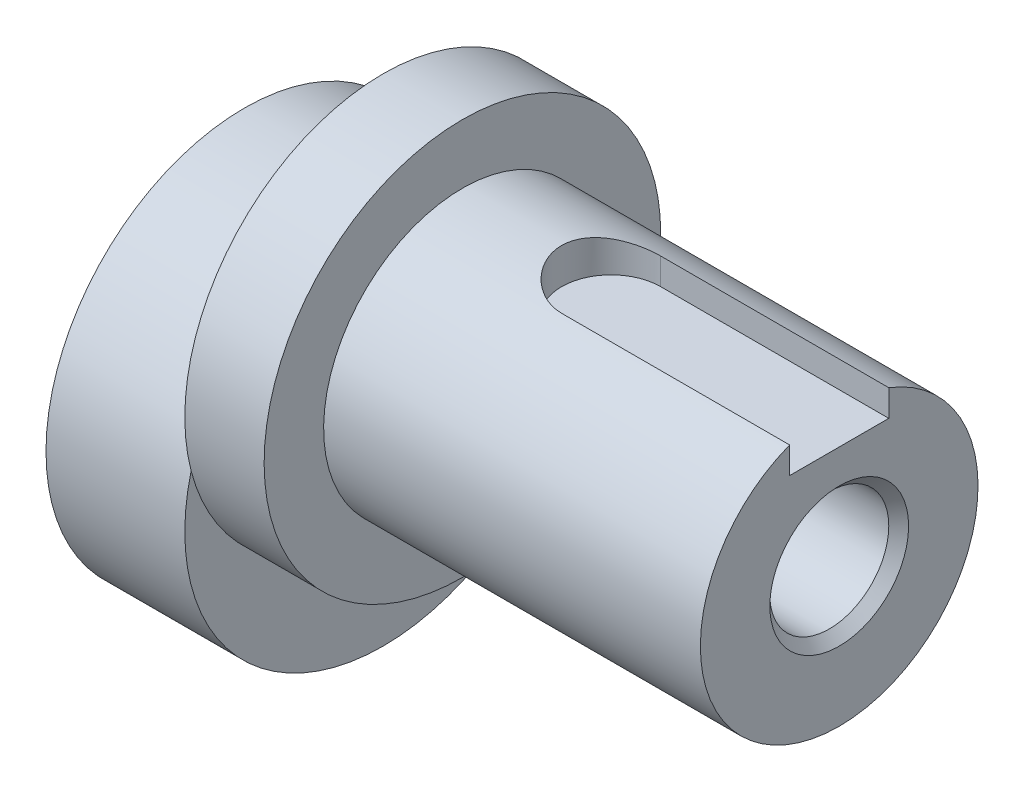
ISO-10303-21;
HEADER;
FILE_DESCRIPTION(('STEP AP214'),'2;1');
FILE_NAME('part.step','',(''),(''),'','','');
FILE_SCHEMA(('AUTOMOTIVE_DESIGN { 1 0 10303 214 1 1 1 1 }'));
ENDSEC;
DATA;
#1=APPLICATION_CONTEXT('core data for automotive mechanical design processes');
#2=APPLICATION_PROTOCOL_DEFINITION('international standard','automotive_design',2000,#1);
#3=PRODUCT_CONTEXT('',#1,'mechanical');
#4=PRODUCT('Part','Part','',(#3));
#5=PRODUCT_RELATED_PRODUCT_CATEGORY('part','',(#4));
#6=PRODUCT_DEFINITION_FORMATION('','',#4);
#7=PRODUCT_DEFINITION_CONTEXT('part definition',#1,'design');
#8=PRODUCT_DEFINITION('design','',#6,#7);
#9=PRODUCT_DEFINITION_SHAPE('','',#8);
#10=(LENGTH_UNIT() NAMED_UNIT(*) SI_UNIT(.MILLI.,.METRE.));
#11=(NAMED_UNIT(*) PLANE_ANGLE_UNIT() SI_UNIT($,.RADIAN.));
#12=(NAMED_UNIT(*) SI_UNIT($,.STERADIAN.) SOLID_ANGLE_UNIT());
#13=UNCERTAINTY_MEASURE_WITH_UNIT(LENGTH_MEASURE(1.E-05),#10,'distance_accuracy_value','');
#14=(GEOMETRIC_REPRESENTATION_CONTEXT(3) GLOBAL_UNCERTAINTY_ASSIGNED_CONTEXT((#13)) GLOBAL_UNIT_ASSIGNED_CONTEXT((#10,
#11,#12)) REPRESENTATION_CONTEXT('',''));
#15=CARTESIAN_POINT('',(0.,0.,0.));
#16=DIRECTION('',(0.,0.,1.));
#17=DIRECTION('',(1.,0.,0.));
#18=AXIS2_PLACEMENT_3D('',#15,#16,#17);
#19=CARTESIAN_POINT('',(30.,5.,0.));
#20=DIRECTION('',(-1.,0.,0.));
#21=DIRECTION('',(0.,0.,1.));
#22=AXIS2_PLACEMENT_3D('',#19,#20,#21);
#23=CYLINDRICAL_SURFACE('',#22,7.);
#24=CARTESIAN_POINT('',(11.,5.,0.));
#25=DIRECTION('',(1.,0.,0.));
#26=DIRECTION('',(0.,0.,-1.));
#27=AXIS2_PLACEMENT_3D('',#24,#25,#26);
#28=CIRCLE('',#27,7.);
#29=CARTESIAN_POINT('',(11.,5.,-7.));
#30=VERTEX_POINT('',#29);
#31=EDGE_CURVE('E123',#30,#30,#28,.T.);
#32=ORIENTED_EDGE('',*,*,#31,.T.);
#33=EDGE_LOOP('',(#32));
#34=FACE_BOUND('',#33,.T.);
#35=DIRECTION('',(-1.,0.,0.));
#36=VECTOR('',#35,1.);
#37=CARTESIAN_POINT('',(30.,11.538348415311,-2.5));
#38=LINE('',#37,#36);
#39=CARTESIAN_POINT('',(30.,11.538348415311,-2.5));
#40=VERTEX_POINT('',#39);
#41=CARTESIAN_POINT('',(18.5,11.538348415311,-2.5));
#42=VERTEX_POINT('',#41);
#43=EDGE_CURVE('E99',#40,#42,#38,.T.);
#44=ORIENTED_EDGE('',*,*,#43,.F.);
#45=CARTESIAN_POINT('',(30.,5.,0.));
#46=DIRECTION('',(1.,0.,0.));
#47=DIRECTION('',(0.,0.,-1.));
#48=AXIS2_PLACEMENT_3D('',#45,#46,#47);
#49=CIRCLE('',#48,7.);
#50=CARTESIAN_POINT('',(30.,11.538348415311,2.5));
#51=VERTEX_POINT('',#50);
#52=EDGE_CURVE('E119',#51,#40,#49,.T.);
#53=ORIENTED_EDGE('',*,*,#52,.F.);
#54=DIRECTION('',(-1.,0.,0.));
#55=VECTOR('',#54,1.);
#56=CARTESIAN_POINT('',(30.,11.538348415311,2.5));
#57=LINE('',#56,#55);
#58=CARTESIAN_POINT('',(18.5,11.538348415311,2.5));
#59=VERTEX_POINT('',#58);
#60=EDGE_CURVE('E103',#59,#51,#57,.F.);
#61=ORIENTED_EDGE('',*,*,#60,.F.);
#62=CARTESIAN_POINT('',(18.5,11.538348415311,-2.5));
#63=CARTESIAN_POINT('',(18.4321107542711,11.5383365378513,-2.50000932220903));
#64=CARTESIAN_POINT('',(18.3642280673609,11.5394054992274,-2.49723485076694));
#65=CARTESIAN_POINT('',(18.2289960893886,11.5436165747813,-2.4861910211816));
#66=CARTESIAN_POINT('',(18.1616466413939,11.5467580541806,-2.47792334551208));
#67=CARTESIAN_POINT('',(18.0281785853972,11.5550121763794,-2.456001752859));
#68=CARTESIAN_POINT('',(17.9620566636602,11.5601183170568,-2.44236559963955));
#69=CARTESIAN_POINT('',(17.8312981648915,11.5721317785417,-2.40985115466648));
#70=CARTESIAN_POINT('',(17.7666616536876,11.5790391790075,-2.39097263107435));
#71=CARTESIAN_POINT('',(17.5757356335225,11.6021493436571,-2.32673964179204));
#72=CARTESIAN_POINT('',(17.4522095478644,11.6207547534084,-2.27375112606986));
#73=CARTESIAN_POINT('',(17.215769666872,11.6622539736071,-2.14910757865425));
#74=CARTESIAN_POINT('',(17.1028636832645,11.6851509042488,-2.07743895048849));
#75=CARTESIAN_POINT('',(16.8857847866473,11.7337991379222,-1.9140257110197));
#76=CARTESIAN_POINT('',(16.7821535248041,11.7596286404137,-1.82158337146744));
#77=CARTESIAN_POINT('',(16.5914912952836,11.8105759232303,-1.6207338877633));
#78=CARTESIAN_POINT('',(16.5044634207566,11.8356935701987,-1.51232377552673));
#79=CARTESIAN_POINT('',(16.346910144545,11.8833113327905,-1.27853915335934));
#80=CARTESIAN_POINT('',(16.2769684781395,11.905708352238,-1.15274833789185));
#81=CARTESIAN_POINT('',(16.1594633532026,11.9444235767263,-0.890250825476634));
#82=CARTESIAN_POINT('',(16.111892220954,11.9607438658547,-0.753547890540326));
#83=CARTESIAN_POINT('',(16.0423593978176,11.9849105051071,-0.478829979256174));
#84=CARTESIAN_POINT('',(16.0194608695289,11.9930659435251,-0.341079835227466));
#85=CARTESIAN_POINT('',(15.9969315972223,12.0010879805382,-0.0634643052969036));
#86=CARTESIAN_POINT('',(15.9972944139653,12.000956873027,0.0764004845074482));
#87=CARTESIAN_POINT('',(16.0207112737611,11.9926225804908,0.347593258486945));
#88=CARTESIAN_POINT('',(16.0427447941985,11.9847824358352,0.47902240707872));
#89=CARTESIAN_POINT('',(16.1071734241588,11.9623783250735,0.736175812143607));
#90=CARTESIAN_POINT('',(16.1495696843625,11.9478139789904,0.861899745780464));
#91=CARTESIAN_POINT('',(16.2540469115653,11.9131650689037,1.10616102429807));
#92=CARTESIAN_POINT('',(16.3163957149601,11.8930059216431,1.22457279066906));
#93=CARTESIAN_POINT('',(16.4587793352234,11.8492335561632,1.44953531305523));
#94=CARTESIAN_POINT('',(16.5388195237836,11.8256192895926,1.5560824517677));
#95=CARTESIAN_POINT('',(16.7193232636567,11.7759054780549,1.7603244525607));
#96=CARTESIAN_POINT('',(16.8206497231449,11.7497405584388,1.85724185700417));
#97=CARTESIAN_POINT('',(17.0383273641656,11.6989034246898,2.03299914621296));
#98=CARTESIAN_POINT('',(17.1546839051685,11.6742317476526,2.11183255456462));
#99=CARTESIAN_POINT('',(17.401942598522,11.628778038754,2.25049860898459));
#100=CARTESIAN_POINT('',(17.5330789755054,11.6080787511899,2.30994207989625));
#101=CARTESIAN_POINT('',(17.8043648015822,11.5738821361027,2.4055543972585));
#102=CARTESIAN_POINT('',(17.944499141169,11.5603730716505,2.44176119399954));
#103=CARTESIAN_POINT('',(18.1550305442642,11.5470854224556,2.47705497148627));
#104=CARTESIAN_POINT('',(18.2237363017718,11.5438201096791,2.48565347586445));
#105=CARTESIAN_POINT('',(18.3616151641917,11.5394491082968,2.49712352174882));
#106=CARTESIAN_POINT('',(18.4307876671005,11.5383410314093,2.50000139665367));
#107=CARTESIAN_POINT('',(18.5,11.538348415311,2.5));
#108=B_SPLINE_CURVE_WITH_KNOTS('',3,(#62,#63,#64,#65,#66,#67,#68,#69,#70,#71,#72,#73,#74,#75,
#76,#77,#78,#79,#80,#81,#82,#83,#84,#85,#86,#87,#88,#89,#90,#91,#92,#93,#94,#95,#96,#97,#98,#99,
#100,#101,#102,#103,#104,#105,#106,#107),.UNSPECIFIED.,.F.,.F.,(4,2,2,2,2,2,2,2,2,2,2,2,2,2,2,2,
2,2,2,2,2,2,4),(0.,0.203591628551589,0.407120929225528,0.609982356545741,0.812852756635989,
1.21793118555512,1.6233052814847,2.0451597231193,2.4670926781184,2.90188398965561,
3.33652604665238,3.75400993940861,4.17137826416922,4.56998920861347,4.96862268086888,
5.37284909448639,5.77719841367921,6.20315837945087,6.6292706567472,7.06347329058504,
7.49696496492444,7.70468580162772,7.91217653896403),.UNSPECIFIED.);
#109=EDGE_CURVE('E11',#42,#59,#108,.T.);
#110=ORIENTED_EDGE('',*,*,#109,.F.);
#111=EDGE_LOOP('',(#44,#53,#61,#110));
#112=FACE_BOUND('',#111,.T.);
#113=ADVANCED_FACE('F39',(#34,#112),#23,.T.);
#114=CARTESIAN_POINT('',(30.,5.,0.));
#115=DIRECTION('',(1.,0.,0.));
#116=DIRECTION('',(0.,0.,-1.));
#117=AXIS2_PLACEMENT_3D('',#114,#115,#116);
#118=PLANE('',#117);
#119=CARTESIAN_POINT('',(30.,5.,0.));
#120=DIRECTION('',(1.,0.,0.));
#121=DIRECTION('',(0.,0.,-1.));
#122=AXIS2_PLACEMENT_3D('',#119,#120,#121);
#123=CIRCLE('',#122,3.50000000000002);
#124=CARTESIAN_POINT('',(30.,5.,-3.50000000000002));
#125=VERTEX_POINT('',#124);
#126=EDGE_CURVE('E143',#125,#125,#123,.F.);
#127=ORIENTED_EDGE('',*,*,#126,.T.);
#128=EDGE_LOOP('',(#127));
#129=FACE_BOUND('',#128,.T.);
#130=ORIENTED_EDGE('',*,*,#52,.T.);
#131=DIRECTION('',(0.,-1.,0.));
#132=VECTOR('',#131,1.);
#133=CARTESIAN_POINT('',(30.,5.,-2.5));
#134=LINE('',#133,#132);
#135=CARTESIAN_POINT('',(30.,10.2,-2.5));
#136=VERTEX_POINT('',#135);
#137=EDGE_CURVE('E53',#40,#136,#134,.T.);
#138=ORIENTED_EDGE('',*,*,#137,.T.);
#139=DIRECTION('',(0.,0.,1.));
#140=VECTOR('',#139,1.);
#141=CARTESIAN_POINT('',(30.,10.2,0.));
#142=LINE('',#141,#140);
#143=CARTESIAN_POINT('',(30.,10.2,2.5));
#144=VERTEX_POINT('',#143);
#145=EDGE_CURVE('E109',#136,#144,#142,.T.);
#146=ORIENTED_EDGE('',*,*,#145,.T.);
#147=DIRECTION('',(0.,1.,0.));
#148=VECTOR('',#147,1.);
#149=CARTESIAN_POINT('',(30.,5.,2.5));
#150=LINE('',#149,#148);
#151=EDGE_CURVE('E150',#144,#51,#150,.T.);
#152=ORIENTED_EDGE('',*,*,#151,.T.);
#153=EDGE_LOOP('',(#130,#138,#146,#152));
#154=FACE_BOUND('',#153,.T.);
#155=ADVANCED_FACE('F153',(#129,#154),#118,.T.);
#156=CARTESIAN_POINT('',(7.,0.,0.));
#157=DIRECTION('',(-1.,0.,0.));
#158=DIRECTION('',(0.,0.,1.));
#159=AXIS2_PLACEMENT_3D('',#156,#157,#158);
#160=CYLINDRICAL_SURFACE('',#159,10.);
#161=CARTESIAN_POINT('',(7.,0.,0.));
#162=DIRECTION('',(1.,0.,0.));
#163=DIRECTION('',(0.,0.,-1.));
#164=AXIS2_PLACEMENT_3D('',#161,#162,#163);
#165=CIRCLE('',#164,10.);
#166=CARTESIAN_POINT('',(7.,2.49999999999999,-9.68245836551854));
#167=VERTEX_POINT('',#166);
#168=CARTESIAN_POINT('',(7.,2.49999999999999,9.68245836551854));
#169=VERTEX_POINT('',#168);
#170=EDGE_CURVE('E127',#167,#169,#165,.T.);
#171=ORIENTED_EDGE('',*,*,#170,.F.);
#172=EDGE_CURVE('E135',#169,#167,#165,.T.);
#173=ORIENTED_EDGE('',*,*,#172,.F.);
#174=EDGE_LOOP('',(#171,#173));
#175=FACE_BOUND('',#174,.T.);
#176=CARTESIAN_POINT('',(0.,0.,0.));
#177=DIRECTION('',(1.,0.,0.));
#178=DIRECTION('',(0.,0.,-1.));
#179=AXIS2_PLACEMENT_3D('',#176,#177,#178);
#180=CIRCLE('',#179,10.);
#181=CARTESIAN_POINT('',(0.,0.,-10.));
#182=VERTEX_POINT('',#181);
#183=EDGE_CURVE('E131',#182,#182,#180,.T.);
#184=ORIENTED_EDGE('',*,*,#183,.T.);
#185=EDGE_LOOP('',(#184));
#186=FACE_BOUND('',#185,.T.);
#187=ADVANCED_FACE('F172',(#175,#186),#160,.T.);
#188=CARTESIAN_POINT('',(7.,0.,0.));
#189=DIRECTION('',(1.,0.,0.));
#190=DIRECTION('',(0.,0.,-1.));
#191=AXIS2_PLACEMENT_3D('',#188,#189,#190);
#192=PLANE('',#191);
#193=CARTESIAN_POINT('',(7.,5.,0.));
#194=DIRECTION('',(1.,0.,0.));
#195=DIRECTION('',(0.,0.,-1.));
#196=AXIS2_PLACEMENT_3D('',#193,#194,#195);
#197=CIRCLE('',#196,10.);
#198=EDGE_CURVE('E67',#169,#167,#197,.T.);
#199=ORIENTED_EDGE('',*,*,#198,.F.);
#200=ORIENTED_EDGE('',*,*,#172,.T.);
#201=EDGE_LOOP('',(#199,#200));
#202=FACE_BOUND('',#201,.T.);
#203=ADVANCED_FACE('F192',(#202),#192,.T.);
#204=CARTESIAN_POINT('',(0.,0.,0.));
#205=DIRECTION('',(1.,0.,0.));
#206=DIRECTION('',(0.,0.,-1.));
#207=AXIS2_PLACEMENT_3D('',#204,#205,#206);
#208=PLANE('',#207);
#209=CARTESIAN_POINT('',(0.,5.,0.));
#210=DIRECTION('',(1.,0.,0.));
#211=DIRECTION('',(0.,0.,-1.));
#212=AXIS2_PLACEMENT_3D('',#209,#210,#211);
#213=CIRCLE('',#212,3.5);
#214=CARTESIAN_POINT('',(0.,5.,-3.5));
#215=VERTEX_POINT('',#214);
#216=EDGE_CURVE('E146',#215,#215,#213,.T.);
#217=ORIENTED_EDGE('',*,*,#216,.T.);
#218=EDGE_LOOP('',(#217));
#219=FACE_BOUND('',#218,.T.);
#220=ORIENTED_EDGE('',*,*,#183,.F.);
#221=EDGE_LOOP('',(#220));
#222=FACE_BOUND('',#221,.T.);
#223=ADVANCED_FACE('F187',(#219,#222),#208,.F.);
#224=CARTESIAN_POINT('',(7.,5.,0.));
#225=DIRECTION('',(1.,0.,0.));
#226=DIRECTION('',(0.,0.,-1.));
#227=AXIS2_PLACEMENT_3D('',#224,#225,#226);
#228=PLANE('',#227);
#229=EDGE_CURVE('E122',#167,#169,#197,.T.);
#230=ORIENTED_EDGE('',*,*,#229,.F.);
#231=ORIENTED_EDGE('',*,*,#170,.T.);
#232=EDGE_LOOP('',(#230,#231));
#233=FACE_BOUND('',#232,.T.);
#234=ADVANCED_FACE('F184',(#233),#228,.F.);
#235=CARTESIAN_POINT('',(11.,5.,0.));
#236=DIRECTION('',(-1.,0.,0.));
#237=DIRECTION('',(0.,0.,1.));
#238=AXIS2_PLACEMENT_3D('',#235,#236,#237);
#239=CYLINDRICAL_SURFACE('',#238,10.);
#240=CARTESIAN_POINT('',(11.,5.,0.));
#241=DIRECTION('',(1.,0.,0.));
#242=DIRECTION('',(0.,0.,-1.));
#243=AXIS2_PLACEMENT_3D('',#240,#241,#242);
#244=CIRCLE('',#243,10.);
#245=CARTESIAN_POINT('',(11.,5.,-10.));
#246=VERTEX_POINT('',#245);
#247=EDGE_CURVE('E128',#246,#246,#244,.T.);
#248=ORIENTED_EDGE('',*,*,#247,.F.);
#249=EDGE_LOOP('',(#248));
#250=FACE_BOUND('',#249,.T.);
#251=ORIENTED_EDGE('',*,*,#198,.T.);
#252=ORIENTED_EDGE('',*,*,#229,.T.);
#253=EDGE_LOOP('',(#251,#252));
#254=FACE_BOUND('',#253,.T.);
#255=ADVANCED_FACE('F182',(#250,#254),#239,.T.);
#256=CARTESIAN_POINT('',(11.,5.,0.));
#257=DIRECTION('',(1.,0.,0.));
#258=DIRECTION('',(0.,0.,-1.));
#259=AXIS2_PLACEMENT_3D('',#256,#257,#258);
#260=PLANE('',#259);
#261=ORIENTED_EDGE('',*,*,#31,.F.);
#262=EDGE_LOOP('',(#261));
#263=FACE_BOUND('',#262,.T.);
#264=ORIENTED_EDGE('',*,*,#247,.T.);
#265=EDGE_LOOP('',(#264));
#266=FACE_BOUND('',#265,.T.);
#267=ADVANCED_FACE('F178',(#263,#266),#260,.T.);
#268=CARTESIAN_POINT('',(0.,5.,0.));
#269=DIRECTION('',(1.,0.,0.));
#270=DIRECTION('',(0.,0.,-1.));
#271=AXIS2_PLACEMENT_3D('',#268,#269,#270);
#272=CYLINDRICAL_SURFACE('',#271,3.);
#273=CARTESIAN_POINT('',(29.5,5.,0.));
#274=DIRECTION('',(1.,0.,0.));
#275=DIRECTION('',(0.,0.,-1.));
#276=AXIS2_PLACEMENT_3D('',#273,#274,#275);
#277=CIRCLE('',#276,3.);
#278=CARTESIAN_POINT('',(29.5,5.,-3.));
#279=VERTEX_POINT('',#278);
#280=EDGE_CURVE('E140',#279,#279,#277,.T.);
#281=ORIENTED_EDGE('',*,*,#280,.T.);
#282=EDGE_LOOP('',(#281));
#283=FACE_BOUND('',#282,.T.);
#284=CARTESIAN_POINT('',(0.500000000000003,5.,0.));
#285=DIRECTION('',(1.,0.,0.));
#286=DIRECTION('',(0.,0.,-1.));
#287=AXIS2_PLACEMENT_3D('',#284,#285,#286);
#288=CIRCLE('',#287,3.);
#289=CARTESIAN_POINT('',(0.500000000000003,5.,-3.));
#290=VERTEX_POINT('',#289);
#291=EDGE_CURVE('E126',#290,#290,#288,.F.);
#292=ORIENTED_EDGE('',*,*,#291,.T.);
#293=EDGE_LOOP('',(#292));
#294=FACE_BOUND('',#293,.T.);
#295=ADVANCED_FACE('F181',(#283,#294),#272,.F.);
#296=CARTESIAN_POINT('',(29.5,5.,0.));
#297=DIRECTION('',(1.,0.,0.));
#298=DIRECTION('',(0.,0.,-1.));
#299=AXIS2_PLACEMENT_3D('',#296,#297,#298);
#300=CONICAL_SURFACE('',#299,3.,0.785398163397451);
#301=ORIENTED_EDGE('',*,*,#126,.F.);
#302=EDGE_LOOP('',(#301));
#303=FACE_BOUND('',#302,.T.);
#304=ORIENTED_EDGE('',*,*,#280,.F.);
#305=EDGE_LOOP('',(#304));
#306=FACE_BOUND('',#305,.T.);
#307=ADVANCED_FACE('F200',(#303,#306),#300,.F.);
#308=CARTESIAN_POINT('',(0.,5.,0.));
#309=DIRECTION('',(-1.,0.,0.));
#310=DIRECTION('',(0.,0.,1.));
#311=AXIS2_PLACEMENT_3D('',#308,#309,#310);
#312=CONICAL_SURFACE('',#311,3.5,0.785398163397445);
#313=ORIENTED_EDGE('',*,*,#291,.F.);
#314=EDGE_LOOP('',(#313));
#315=FACE_BOUND('',#314,.T.);
#316=ORIENTED_EDGE('',*,*,#216,.F.);
#317=EDGE_LOOP('',(#316));
#318=FACE_BOUND('',#317,.T.);
#319=ADVANCED_FACE('F41',(#315,#318),#312,.F.);
#320=CARTESIAN_POINT('',(18.5,15.,0.));
#321=DIRECTION('',(0.,-1.,0.));
#322=DIRECTION('',(0.,0.,-1.));
#323=AXIS2_PLACEMENT_3D('',#320,#321,#322);
#324=CYLINDRICAL_SURFACE('',#323,2.5);
#325=ORIENTED_EDGE('',*,*,#109,.T.);
#326=DIRECTION('',(0.,-1.,0.));
#327=VECTOR('',#326,1.);
#328=CARTESIAN_POINT('',(18.5,15.,2.5));
#329=LINE('',#328,#327);
#330=CARTESIAN_POINT('',(18.5,10.2,2.5));
#331=VERTEX_POINT('',#330);
#332=EDGE_CURVE('E104',#59,#331,#329,.T.);
#333=ORIENTED_EDGE('',*,*,#332,.T.);
#334=CARTESIAN_POINT('',(18.5,10.2,0.));
#335=DIRECTION('',(0.,1.,0.));
#336=DIRECTION('',(0.,0.,1.));
#337=AXIS2_PLACEMENT_3D('',#334,#335,#336);
#338=CIRCLE('',#337,2.5);
#339=CARTESIAN_POINT('',(18.5,10.2,-2.5));
#340=VERTEX_POINT('',#339);
#341=EDGE_CURVE('E107',#340,#331,#338,.T.);
#342=ORIENTED_EDGE('',*,*,#341,.F.);
#343=DIRECTION('',(0.,-1.,0.));
#344=VECTOR('',#343,1.);
#345=CARTESIAN_POINT('',(18.5,15.,-2.5));
#346=LINE('',#345,#344);
#347=EDGE_CURVE('E93',#42,#340,#346,.T.);
#348=ORIENTED_EDGE('',*,*,#347,.F.);
#349=EDGE_LOOP('',(#325,#333,#342,#348));
#350=FACE_BOUND('',#349,.T.);
#351=ADVANCED_FACE('F111',(#350),#324,.F.);
#352=CARTESIAN_POINT('',(31.,15.,-2.5));
#353=DIRECTION('',(0.,0.,1.));
#354=DIRECTION('',(1.,0.,0.));
#355=AXIS2_PLACEMENT_3D('',#352,#353,#354);
#356=PLANE('',#355);
#357=ORIENTED_EDGE('',*,*,#43,.T.);
#358=ORIENTED_EDGE('',*,*,#347,.T.);
#359=DIRECTION('',(-1.,0.,0.));
#360=VECTOR('',#359,1.);
#361=CARTESIAN_POINT('',(31.,10.2,-2.5));
#362=LINE('',#361,#360);
#363=EDGE_CURVE('E96',#136,#340,#362,.T.);
#364=ORIENTED_EDGE('',*,*,#363,.F.);
#365=ORIENTED_EDGE('',*,*,#137,.F.);
#366=EDGE_LOOP('',(#357,#358,#364,#365));
#367=FACE_BOUND('',#366,.T.);
#368=ADVANCED_FACE('F95',(#367),#356,.T.);
#369=CARTESIAN_POINT('',(31.,15.,2.5));
#370=DIRECTION('',(0.,0.,-1.));
#371=DIRECTION('',(-1.,0.,0.));
#372=AXIS2_PLACEMENT_3D('',#369,#370,#371);
#373=PLANE('',#372);
#374=ORIENTED_EDGE('',*,*,#60,.T.);
#375=ORIENTED_EDGE('',*,*,#151,.F.);
#376=DIRECTION('',(1.,0.,0.));
#377=VECTOR('',#376,1.);
#378=CARTESIAN_POINT('',(31.,10.2,2.5));
#379=LINE('',#378,#377);
#380=EDGE_CURVE('E60',#331,#144,#379,.T.);
#381=ORIENTED_EDGE('',*,*,#380,.F.);
#382=ORIENTED_EDGE('',*,*,#332,.F.);
#383=EDGE_LOOP('',(#374,#375,#381,#382));
#384=FACE_BOUND('',#383,.T.);
#385=ADVANCED_FACE('F158',(#384),#373,.T.);
#386=CARTESIAN_POINT('',(18.5,10.2,0.));
#387=DIRECTION('',(0.,1.,0.));
#388=DIRECTION('',(0.,0.,1.));
#389=AXIS2_PLACEMENT_3D('',#386,#387,#388);
#390=PLANE('',#389);
#391=ORIENTED_EDGE('',*,*,#363,.T.);
#392=ORIENTED_EDGE('',*,*,#341,.T.);
#393=ORIENTED_EDGE('',*,*,#380,.T.);
#394=ORIENTED_EDGE('',*,*,#145,.F.);
#395=EDGE_LOOP('',(#391,#392,#393,#394));
#396=FACE_BOUND('',#395,.T.);
#397=ADVANCED_FACE('F106',(#396),#390,.T.);
#398=CLOSED_SHELL('',(#113,#155,#187,#203,#223,#234,#255,#267,#295,#307,#319,#351,#368,#385,#397));
#399=MANIFOLD_SOLID_BREP('B2',#398);
#400=ADVANCED_BREP_SHAPE_REPRESENTATION('',(#18,#399),#14);
#401=SHAPE_DEFINITION_REPRESENTATION(#9,#400);
ENDSEC;
END-ISO-10303-21;
